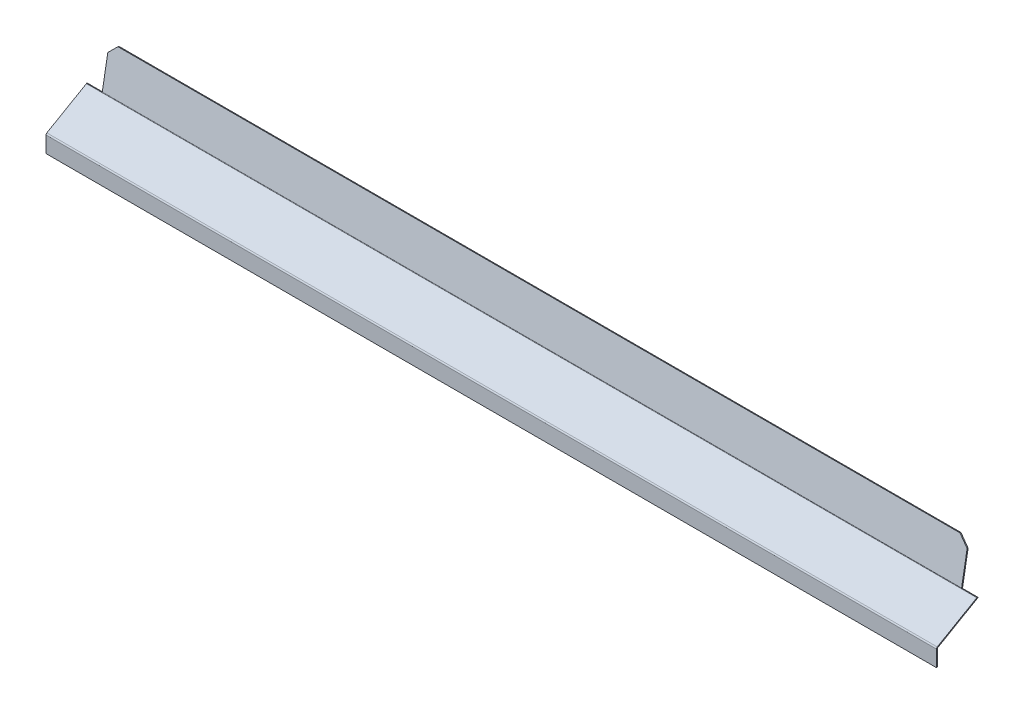
ISO-10303-21;
HEADER;
FILE_DESCRIPTION(('STEP AP214'),'2;1');
FILE_NAME('part.step','',(''),(''),'','','');
FILE_SCHEMA(('AUTOMOTIVE_DESIGN { 1 0 10303 214 1 1 1 1 }'));
ENDSEC;
DATA;
#1=APPLICATION_CONTEXT('core data for automotive mechanical design processes');
#2=APPLICATION_PROTOCOL_DEFINITION('international standard','automotive_design',2000,#1);
#3=PRODUCT_CONTEXT('',#1,'mechanical');
#4=PRODUCT('Part','Part','',(#3));
#5=PRODUCT_RELATED_PRODUCT_CATEGORY('part','',(#4));
#6=PRODUCT_DEFINITION_FORMATION('','',#4);
#7=PRODUCT_DEFINITION_CONTEXT('part definition',#1,'design');
#8=PRODUCT_DEFINITION('design','',#6,#7);
#9=PRODUCT_DEFINITION_SHAPE('','',#8);
#10=(LENGTH_UNIT() NAMED_UNIT(*) SI_UNIT(.MILLI.,.METRE.));
#11=(NAMED_UNIT(*) PLANE_ANGLE_UNIT() SI_UNIT($,.RADIAN.));
#12=(NAMED_UNIT(*) SI_UNIT($,.STERADIAN.) SOLID_ANGLE_UNIT());
#13=UNCERTAINTY_MEASURE_WITH_UNIT(LENGTH_MEASURE(1.E-05),#10,'distance_accuracy_value','');
#14=(GEOMETRIC_REPRESENTATION_CONTEXT(3) GLOBAL_UNCERTAINTY_ASSIGNED_CONTEXT((#13)) GLOBAL_UNIT_ASSIGNED_CONTEXT((#10,
#11,#12)) REPRESENTATION_CONTEXT('',''));
#15=CARTESIAN_POINT('',(0.,0.,0.));
#16=DIRECTION('',(0.,0.,1.));
#17=DIRECTION('',(1.,0.,0.));
#18=AXIS2_PLACEMENT_3D('',#15,#16,#17);
#19=CARTESIAN_POINT('',(-514.999999999999,37.1351085053024,-46.3624559304882));
#20=DIRECTION('',(-1.,0.,0.));
#21=DIRECTION('',(0.,-0.173648177666931,-0.984807753012208));
#22=AXIS2_PLACEMENT_3D('',#19,#20,#21);
#23=CYLINDRICAL_SURFACE('',#22,1.9366);
#24=CARTESIAN_POINT('',(-515.,37.1351085053024,-46.3624559304882));
#25=DIRECTION('',(-1.,0.,0.));
#26=DIRECTION('',(0.,0.,1.));
#27=AXIS2_PLACEMENT_3D('',#24,#25,#26);
#28=CIRCLE('',#27,1.9366);
#29=CARTESIAN_POINT('',(-515.,36.2577170242714,-48.0888984430018));
#30=VERTEX_POINT('',#29);
#31=CARTESIAN_POINT('',(-515.,35.4579637083334,-47.3307559304882));
#32=VERTEX_POINT('',#31);
#33=EDGE_CURVE('E376',#30,#32,#28,.T.);
#34=ORIENTED_EDGE('',*,*,#33,.F.);
#35=DIRECTION('',(-1.,0.,0.));
#36=VECTOR('',#35,1.);
#37=CARTESIAN_POINT('',(-514.999999999999,36.2577170242714,-48.0888984430018));
#38=LINE('',#37,#36);
#39=CARTESIAN_POINT('',(-497.,36.2577170242714,-48.0888984430018));
#40=VERTEX_POINT('',#39);
#41=EDGE_CURVE('E219',#40,#30,#38,.T.);
#42=ORIENTED_EDGE('',*,*,#41,.F.);
#43=CARTESIAN_POINT('',(-497.,37.1351085053024,-46.3624559304882));
#44=DIRECTION('',(1.,0.,0.));
#45=DIRECTION('',(0.,0.,-1.));
#46=AXIS2_PLACEMENT_3D('',#43,#44,#45);
#47=CIRCLE('',#46,1.9366);
#48=CARTESIAN_POINT('',(-497.,36.7988214444325,-48.2696346249717));
#49=VERTEX_POINT('',#48);
#50=EDGE_CURVE('E431',#49,#40,#47,.F.);
#51=ORIENTED_EDGE('',*,*,#50,.F.);
#52=DIRECTION('',(-1.,0.,0.));
#53=VECTOR('',#52,1.);
#54=CARTESIAN_POINT('',(0.,36.7988214444326,-48.2696346249717));
#55=LINE('',#54,#53);
#56=CARTESIAN_POINT('',(497.,36.7988214444326,-48.2696346249717));
#57=VERTEX_POINT('',#56);
#58=EDGE_CURVE('E387',#57,#49,#55,.T.);
#59=ORIENTED_EDGE('',*,*,#58,.F.);
#60=CARTESIAN_POINT('',(497.,37.1351085053023,-46.3624559304882));
#61=DIRECTION('',(-1.,0.,0.));
#62=DIRECTION('',(0.,0.,1.));
#63=AXIS2_PLACEMENT_3D('',#60,#61,#62);
#64=CIRCLE('',#63,1.9366);
#65=CARTESIAN_POINT('',(497.,36.2577170242714,-48.0888984430018));
#66=VERTEX_POINT('',#65);
#67=EDGE_CURVE('E409',#57,#66,#64,.T.);
#68=ORIENTED_EDGE('',*,*,#67,.T.);
#69=DIRECTION('',(1.,0.,0.));
#70=VECTOR('',#69,1.);
#71=CARTESIAN_POINT('',(496.999999999999,36.2577170242714,-48.0888984430018));
#72=LINE('',#71,#70);
#73=CARTESIAN_POINT('',(514.999999999999,36.2577170242719,-48.0888984430021));
#74=VERTEX_POINT('',#73);
#75=EDGE_CURVE('E399',#66,#74,#72,.T.);
#76=ORIENTED_EDGE('',*,*,#75,.T.);
#77=CARTESIAN_POINT('',(514.999999999999,37.1351085053024,-46.3624559304882));
#78=DIRECTION('',(-1.,0.,0.));
#79=DIRECTION('',(0.,0.,1.));
#80=AXIS2_PLACEMENT_3D('',#77,#78,#79);
#81=CIRCLE('',#80,1.9366);
#82=CARTESIAN_POINT('',(515.,35.4579637083334,-47.3307559304882));
#83=VERTEX_POINT('',#82);
#84=EDGE_CURVE('E261',#83,#74,#81,.F.);
#85=ORIENTED_EDGE('',*,*,#84,.F.);
#86=DIRECTION('',(-1.,0.,0.));
#87=VECTOR('',#86,1.);
#88=CARTESIAN_POINT('',(-514.999999999999,35.4579637083334,-47.3307559304882));
#89=LINE('',#88,#87);
#90=EDGE_CURVE('E372',#32,#83,#89,.F.);
#91=ORIENTED_EDGE('',*,*,#90,.F.);
#92=EDGE_LOOP('',(#34,#42,#51,#59,#68,#76,#85,#91));
#93=FACE_BOUND('',#92,.T.);
#94=ADVANCED_FACE('F88',(#93),#23,.T.);
#95=CARTESIAN_POINT('',(-514.999999999999,37.1351085053024,-46.3624559304882));
#96=DIRECTION('',(-1.,0.,0.));
#97=DIRECTION('',(0.,-0.173648177666931,-0.984807753012208));
#98=AXIS2_PLACEMENT_3D('',#95,#96,#97);
#99=CYLINDRICAL_SURFACE('',#98,0.736600000000003);
#100=DIRECTION('',(-1.,0.,0.));
#101=VECTOR('',#100,1.);
#102=CARTESIAN_POINT('',(-514.999999999999,36.8013862266039,-47.0191209902412));
#103=LINE('',#102,#101);
#104=CARTESIAN_POINT('',(-497.,36.8013862266039,-47.0191209902412));
#105=VERTEX_POINT('',#104);
#106=CARTESIAN_POINT('',(-515.,36.8013862266039,-47.0191209902412));
#107=VERTEX_POINT('',#106);
#108=EDGE_CURVE('E216',#105,#107,#103,.T.);
#109=ORIENTED_EDGE('',*,*,#108,.T.);
#110=CARTESIAN_POINT('',(-515.,37.1351085053024,-46.3624559304882));
#111=DIRECTION('',(-1.,0.,0.));
#112=DIRECTION('',(0.,0.,1.));
#113=AXIS2_PLACEMENT_3D('',#110,#111,#112);
#114=CIRCLE('',#113,0.736600000000003);
#115=CARTESIAN_POINT('',(-515.,36.4971941928747,-46.7307559304882));
#116=VERTEX_POINT('',#115);
#117=EDGE_CURVE('E230',#107,#116,#114,.T.);
#118=ORIENTED_EDGE('',*,*,#117,.T.);
#119=DIRECTION('',(-1.,0.,0.));
#120=VECTOR('',#119,1.);
#121=CARTESIAN_POINT('',(-514.999999999999,36.4971941928747,-46.7307559304882));
#122=LINE('',#121,#120);
#123=CARTESIAN_POINT('',(515.,36.4971941928747,-46.7307559304882));
#124=VERTEX_POINT('',#123);
#125=EDGE_CURVE('E242',#116,#124,#122,.F.);
#126=ORIENTED_EDGE('',*,*,#125,.T.);
#127=CARTESIAN_POINT('',(515.,37.1351085053024,-46.3624559304882));
#128=DIRECTION('',(-1.,0.,0.));
#129=DIRECTION('',(0.,0.,1.));
#130=AXIS2_PLACEMENT_3D('',#127,#128,#129);
#131=CIRCLE('',#130,0.736600000000003);
#132=CARTESIAN_POINT('',(515.,36.8013862266044,-47.0191209902414));
#133=VERTEX_POINT('',#132);
#134=EDGE_CURVE('E247',#124,#133,#131,.F.);
#135=ORIENTED_EDGE('',*,*,#134,.T.);
#136=DIRECTION('',(1.,0.,0.));
#137=VECTOR('',#136,1.);
#138=CARTESIAN_POINT('',(-1030.00253631797,36.8013862266039,-47.0191209902411));
#139=LINE('',#138,#137);
#140=CARTESIAN_POINT('',(497.,36.8013862266039,-47.0191209902412));
#141=VERTEX_POINT('',#140);
#142=EDGE_CURVE('E406',#141,#133,#139,.T.);
#143=ORIENTED_EDGE('',*,*,#142,.F.);
#144=CARTESIAN_POINT('',(497.,37.1351085053023,-46.3624559304882));
#145=DIRECTION('',(1.,0.,0.));
#146=DIRECTION('',(0.,0.,-1.));
#147=AXIS2_PLACEMENT_3D('',#144,#145,#146);
#148=CIRCLE('',#147,0.7366);
#149=CARTESIAN_POINT('',(497.,37.0071992576329,-47.087865321357));
#150=VERTEX_POINT('',#149);
#151=EDGE_CURVE('E417',#150,#141,#148,.F.);
#152=ORIENTED_EDGE('',*,*,#151,.F.);
#153=DIRECTION('',(1.,0.,0.));
#154=VECTOR('',#153,1.);
#155=CARTESIAN_POINT('',(515.,37.0071992576329,-47.087865321357));
#156=LINE('',#155,#154);
#157=CARTESIAN_POINT('',(-497.,37.0071992576329,-47.087865321357));
#158=VERTEX_POINT('',#157);
#159=EDGE_CURVE('E384',#150,#158,#156,.F.);
#160=ORIENTED_EDGE('',*,*,#159,.T.);
#161=CARTESIAN_POINT('',(-497.,37.1351085053024,-46.3624559304882));
#162=DIRECTION('',(-1.,0.,0.));
#163=DIRECTION('',(0.,0.,1.));
#164=AXIS2_PLACEMENT_3D('',#161,#162,#163);
#165=CIRCLE('',#164,0.736600000000003);
#166=EDGE_CURVE('E234',#158,#105,#165,.T.);
#167=ORIENTED_EDGE('',*,*,#166,.T.);
#168=EDGE_LOOP('',(#109,#118,#126,#135,#143,#152,#160,#167));
#169=FACE_BOUND('',#168,.T.);
#170=ADVANCED_FACE('F229',(#169),#99,.F.);
#171=CARTESIAN_POINT('',(0.,-8.13659562341442,-40.3463082065226));
#172=DIRECTION('',(0.,-0.173648177666931,-0.984807753012208));
#173=DIRECTION('',(0.,0.984807753012208,-0.173648177666931));
#174=AXIS2_PLACEMENT_3D('',#171,#172,#173);
#175=PLANE('',#174);
#176=DIRECTION('',(0.,0.984807753012208,-0.173648177666931));
#177=VECTOR('',#176,1.);
#178=CARTESIAN_POINT('',(-497.,59.9107568811308,-52.3448924188536));
#179=LINE('',#178,#177);
#180=CARTESIAN_POINT('',(-497.,73.1746147877068,-54.6836684360663));
#181=VERTEX_POINT('',#180);
#182=EDGE_CURVE('E437',#181,#49,#179,.F.);
#183=ORIENTED_EDGE('',*,*,#182,.F.);
#184=DIRECTION('',(0.707106781186545,0.696364240320022,-0.122787803968973));
#185=VECTOR('',#184,1.);
#186=CARTESIAN_POINT('',(-289.782783448049,277.243736205679,-90.6665604715266));
#187=LINE('',#186,#185);
#188=CARTESIAN_POINT('',(-487.,83.022692317829,-56.4201502127356));
#189=VERTEX_POINT('',#188);
#190=EDGE_CURVE('E13',#181,#189,#187,.T.);
#191=ORIENTED_EDGE('',*,*,#190,.T.);
#192=DIRECTION('',(-1.,0.,0.));
#193=VECTOR('',#192,1.);
#194=CARTESIAN_POINT('',(-515.,83.022692317829,-56.4201502127356));
#195=LINE('',#194,#193);
#196=CARTESIAN_POINT('',(487.,83.022692317829,-56.4201502127356));
#197=VERTEX_POINT('',#196);
#198=EDGE_CURVE('E243',#197,#189,#195,.T.);
#199=ORIENTED_EDGE('',*,*,#198,.F.);
#200=DIRECTION('',(-0.707106781186545,0.696364240320022,-0.122787803968973));
#201=VECTOR('',#200,1.);
#202=CARTESIAN_POINT('',(289.782783448049,277.243736205679,-90.6665604715266));
#203=LINE('',#202,#201);
#204=CARTESIAN_POINT('',(497.,73.1746147877068,-54.6836684360663));
#205=VERTEX_POINT('',#204);
#206=EDGE_CURVE('E354',#197,#205,#203,.F.);
#207=ORIENTED_EDGE('',*,*,#206,.T.);
#208=DIRECTION('',(0.,0.984807753012208,-0.17364817766693));
#209=VECTOR('',#208,1.);
#210=CARTESIAN_POINT('',(497.,-8.1365956234144,-40.3463082065226));
#211=LINE('',#210,#209);
#212=EDGE_CURVE('E388',#205,#57,#211,.F.);
#213=ORIENTED_EDGE('',*,*,#212,.T.);
#214=ORIENTED_EDGE('',*,*,#58,.T.);
#215=EDGE_LOOP('',(#183,#191,#199,#207,#213,#214));
#216=FACE_BOUND('',#215,.T.);
#217=ADVANCED_FACE('F503',(#216),#175,.T.);
#218=CARTESIAN_POINT('',(0.,-7.9282178102141,-39.1645389029079));
#219=DIRECTION('',(0.,-0.173648177666931,-0.984807753012208));
#220=DIRECTION('',(0.,0.984807753012208,-0.173648177666931));
#221=AXIS2_PLACEMENT_3D('',#218,#219,#220);
#222=PLANE('',#221);
#223=DIRECTION('',(1.,0.,0.));
#224=VECTOR('',#223,1.);
#225=CARTESIAN_POINT('',(0.,83.2310701310293,-55.238380909121));
#226=LINE('',#225,#224);
#227=CARTESIAN_POINT('',(487.,83.2310701310293,-55.238380909121));
#228=VERTEX_POINT('',#227);
#229=CARTESIAN_POINT('',(-487.,83.2310701310293,-55.238380909121));
#230=VERTEX_POINT('',#229);
#231=EDGE_CURVE('E250',#228,#230,#226,.F.);
#232=ORIENTED_EDGE('',*,*,#231,.T.);
#233=DIRECTION('',(-0.707106781186545,-0.696364240320022,0.122787803968973));
#234=VECTOR('',#233,1.);
#235=CARTESIAN_POINT('',(-487.,83.2310701310293,-55.238380909121));
#236=LINE('',#235,#234);
#237=CARTESIAN_POINT('',(-497.,73.3829926009071,-53.5018991324517));
#238=VERTEX_POINT('',#237);
#239=EDGE_CURVE('E112',#230,#238,#236,.T.);
#240=ORIENTED_EDGE('',*,*,#239,.T.);
#241=DIRECTION('',(0.,-0.984807753012208,0.173648177666931));
#242=VECTOR('',#241,1.);
#243=CARTESIAN_POINT('',(-497.,-7.9282178102141,-39.1645389029079));
#244=LINE('',#243,#242);
#245=EDGE_CURVE('E434',#238,#158,#244,.T.);
#246=ORIENTED_EDGE('',*,*,#245,.T.);
#247=ORIENTED_EDGE('',*,*,#159,.F.);
#248=DIRECTION('',(0.,-0.984807753012208,0.17364817766693));
#249=VECTOR('',#248,1.);
#250=CARTESIAN_POINT('',(497.,36.4515034247715,-46.9898811529564));
#251=LINE('',#250,#249);
#252=CARTESIAN_POINT('',(497.,73.3829926009071,-53.5018991324517));
#253=VERTEX_POINT('',#252);
#254=EDGE_CURVE('E396',#253,#150,#251,.T.);
#255=ORIENTED_EDGE('',*,*,#254,.F.);
#256=DIRECTION('',(0.707106781186545,-0.696364240320022,0.122787803968973));
#257=VECTOR('',#256,1.);
#258=CARTESIAN_POINT('',(487.,83.2310701310293,-55.238380909121));
#259=LINE('',#258,#257);
#260=EDGE_CURVE('E360',#253,#228,#259,.F.);
#261=ORIENTED_EDGE('',*,*,#260,.T.);
#262=EDGE_LOOP('',(#232,#240,#246,#247,#255,#261));
#263=FACE_BOUND('',#262,.T.);
#264=ADVANCED_FACE('F442',(#263),#222,.F.);
#265=CARTESIAN_POINT('',(-515.,83.022692317829,-56.4201502127356));
#266=DIRECTION('',(0.,0.984807753012208,-0.17364817766693));
#267=DIRECTION('',(0.,0.17364817766693,0.984807753012208));
#268=AXIS2_PLACEMENT_3D('',#265,#266,#267);
#269=PLANE('',#268);
#270=ORIENTED_EDGE('',*,*,#198,.T.);
#271=DIRECTION('',(0.,0.17364817766693,0.984807753012208));
#272=VECTOR('',#271,1.);
#273=CARTESIAN_POINT('',(-487.,83.022692317829,-56.4201502127356));
#274=LINE('',#273,#272);
#275=EDGE_CURVE('E363',#189,#230,#274,.T.);
#276=ORIENTED_EDGE('',*,*,#275,.T.);
#277=ORIENTED_EDGE('',*,*,#231,.F.);
#278=DIRECTION('',(0.,-0.17364817766693,-0.984807753012208));
#279=VECTOR('',#278,1.);
#280=CARTESIAN_POINT('',(487.,83.022692317829,-56.4201502127356));
#281=LINE('',#280,#279);
#282=EDGE_CURVE('E347',#228,#197,#281,.T.);
#283=ORIENTED_EDGE('',*,*,#282,.T.);
#284=EDGE_LOOP('',(#270,#276,#277,#283));
#285=FACE_BOUND('',#284,.T.);
#286=ADVANCED_FACE('F506',(#285),#269,.T.);
#287=CARTESIAN_POINT('',(-515.,37.1351085053024,-46.3624559304882));
#288=DIRECTION('',(1.,0.,0.));
#289=DIRECTION('',(0.,0.,-1.));
#290=AXIS2_PLACEMENT_3D('',#287,#288,#289);
#291=PLANE('',#290);
#292=ORIENTED_EDGE('',*,*,#117,.F.);
#293=DIRECTION('',(0.,-0.453057668610422,-0.891481210633903));
#294=VECTOR('',#293,1.);
#295=CARTESIAN_POINT('',(-515.,36.2577170242714,-48.0888984430018));
#296=LINE('',#295,#294);
#297=EDGE_CURVE('E212',#30,#107,#296,.F.);
#298=ORIENTED_EDGE('',*,*,#297,.F.);
#299=ORIENTED_EDGE('',*,*,#33,.T.);
#300=DIRECTION('',(0.,-0.866025403784439,-0.5));
#301=VECTOR('',#300,1.);
#302=CARTESIAN_POINT('',(-515.,36.4971941928747,-46.7307559304882));
#303=LINE('',#302,#301);
#304=EDGE_CURVE('E239',#116,#32,#303,.T.);
#305=ORIENTED_EDGE('',*,*,#304,.F.);
#306=EDGE_LOOP('',(#292,#298,#299,#305));
#307=FACE_BOUND('',#306,.T.);
#308=ADVANCED_FACE('F237',(#307),#291,.F.);
#309=CARTESIAN_POINT('',(515.,37.1351085053024,-46.3624559304882));
#310=DIRECTION('',(1.,0.,0.));
#311=DIRECTION('',(0.,0.,-1.));
#312=AXIS2_PLACEMENT_3D('',#309,#310,#311);
#313=PLANE('',#312);
#314=ORIENTED_EDGE('',*,*,#84,.T.);
#315=DIRECTION('',(0.,-0.453057668610419,-0.891481210633904));
#316=VECTOR('',#315,1.);
#317=CARTESIAN_POINT('',(515.,36.2577170242714,-48.0888984430018));
#318=LINE('',#317,#316);
#319=EDGE_CURVE('E403',#133,#74,#318,.T.);
#320=ORIENTED_EDGE('',*,*,#319,.F.);
#321=ORIENTED_EDGE('',*,*,#134,.F.);
#322=DIRECTION('',(6.02890591705213E-13,-0.866025403784439,-0.5));
#323=VECTOR('',#322,1.);
#324=CARTESIAN_POINT('',(515.,36.4971941928747,-46.7307559304882));
#325=LINE('',#324,#323);
#326=EDGE_CURVE('E254',#124,#83,#325,.T.);
#327=ORIENTED_EDGE('',*,*,#326,.T.);
#328=EDGE_LOOP('',(#314,#320,#321,#327));
#329=FACE_BOUND('',#328,.T.);
#330=ADVANCED_FACE('F462',(#329),#313,.T.);
#331=CARTESIAN_POINT('',(515.,37.4521796769726,-48.3848393094365));
#332=DIRECTION('',(-1.,0.,0.));
#333=DIRECTION('',(0.,0.,1.));
#334=AXIS2_PLACEMENT_3D('',#331,#332,#333);
#335=PLANE('',#334);
#336=ORIENTED_EDGE('',*,*,#326,.F.);
#337=DIRECTION('',(0.,0.500000000000004,-0.866025403784437));
#338=VECTOR('',#337,1.);
#339=CARTESIAN_POINT('',(515.,6.79147459621551,4.72105968631958));
#340=LINE('',#339,#338);
#341=CARTESIAN_POINT('',(515.,10.0762279426287,-0.968299999999958));
#342=VERTEX_POINT('',#341);
#343=EDGE_CURVE('E266',#342,#124,#340,.T.);
#344=ORIENTED_EDGE('',*,*,#343,.F.);
#345=DIRECTION('',(0.,-0.866025403784437,-0.500000000000004));
#346=VECTOR('',#345,1.);
#347=CARTESIAN_POINT('',(515.,9.03699745808741,-1.56829999999996));
#348=LINE('',#347,#346);
#349=CARTESIAN_POINT('',(515.,9.03699745808745,-1.56829999999989));
#350=VERTEX_POINT('',#349);
#351=EDGE_CURVE('E281',#350,#342,#348,.F.);
#352=ORIENTED_EDGE('',*,*,#351,.F.);
#353=DIRECTION('',(0.,-0.500000000000004,0.866025403784437));
#354=VECTOR('',#353,1.);
#355=CARTESIAN_POINT('',(515.,36.4129491924313,-48.9848393094365));
#356=LINE('',#355,#354);
#357=EDGE_CURVE('E273',#350,#83,#356,.F.);
#358=ORIENTED_EDGE('',*,*,#357,.T.);
#359=EDGE_LOOP('',(#336,#344,#352,#358));
#360=FACE_BOUND('',#359,.T.);
#361=ADVANCED_FACE('F472',(#360),#335,.F.);
#362=CARTESIAN_POINT('',(-515.,9.86358983848621,-0.599999999999995));
#363=DIRECTION('',(1.,0.,0.));
#364=DIRECTION('',(0.,0.,-1.));
#365=AXIS2_PLACEMENT_3D('',#362,#363,#364);
#366=PLANE('',#365);
#367=ORIENTED_EDGE('',*,*,#304,.T.);
#368=DIRECTION('',(0.,0.500000000000004,-0.866025403784437));
#369=VECTOR('',#368,1.);
#370=CARTESIAN_POINT('',(-515.,8.82435935394489,-1.2));
#371=LINE('',#370,#369);
#372=CARTESIAN_POINT('',(-515.,9.03699745808745,-1.56830000000004));
#373=VERTEX_POINT('',#372);
#374=EDGE_CURVE('E270',#32,#373,#371,.F.);
#375=ORIENTED_EDGE('',*,*,#374,.T.);
#376=DIRECTION('',(0.,-0.866025403784437,-0.500000000000004));
#377=VECTOR('',#376,1.);
#378=CARTESIAN_POINT('',(-515.,10.0762279426288,-0.968299999999992));
#379=LINE('',#378,#377);
#380=CARTESIAN_POINT('',(-515.,10.0762279426288,-0.968300000000031));
#381=VERTEX_POINT('',#380);
#382=EDGE_CURVE('E258',#373,#381,#379,.F.);
#383=ORIENTED_EDGE('',*,*,#382,.T.);
#384=DIRECTION('',(0.,-0.500000000000004,0.866025403784437));
#385=VECTOR('',#384,1.);
#386=CARTESIAN_POINT('',(-515.,6.79147459621551,4.72105968631958));
#387=LINE('',#386,#385);
#388=EDGE_CURVE('E262',#116,#381,#387,.T.);
#389=ORIENTED_EDGE('',*,*,#388,.F.);
#390=EDGE_LOOP('',(#367,#375,#383,#389));
#391=FACE_BOUND('',#390,.T.);
#392=ADVANCED_FACE('F488',(#391),#366,.F.);
#393=CARTESIAN_POINT('',(0.,6.79147459621551,4.72105968631958));
#394=DIRECTION('',(0.,-0.866025403784437,-0.500000000000004));
#395=DIRECTION('',(0.,0.500000000000004,-0.866025403784437));
#396=AXIS2_PLACEMENT_3D('',#393,#394,#395);
#397=PLANE('',#396);
#398=ORIENTED_EDGE('',*,*,#125,.F.);
#399=ORIENTED_EDGE('',*,*,#388,.T.);
#400=DIRECTION('',(1.,0.,0.));
#401=VECTOR('',#400,1.);
#402=CARTESIAN_POINT('',(-515.,10.0762279426288,-0.968299999999992));
#403=LINE('',#402,#401);
#404=EDGE_CURVE('E277',#342,#381,#403,.F.);
#405=ORIENTED_EDGE('',*,*,#404,.F.);
#406=ORIENTED_EDGE('',*,*,#343,.T.);
#407=EDGE_LOOP('',(#398,#399,#405,#406));
#408=FACE_BOUND('',#407,.T.);
#409=ADVANCED_FACE('F478',(#408),#397,.F.);
#410=CARTESIAN_POINT('',(0.,5.75224411167419,4.12105968631958));
#411=DIRECTION('',(0.,-0.866025403784437,-0.500000000000004));
#412=DIRECTION('',(0.,0.500000000000004,-0.866025403784437));
#413=AXIS2_PLACEMENT_3D('',#410,#411,#412);
#414=PLANE('',#413);
#415=ORIENTED_EDGE('',*,*,#374,.F.);
#416=ORIENTED_EDGE('',*,*,#90,.T.);
#417=ORIENTED_EDGE('',*,*,#357,.F.);
#418=DIRECTION('',(1.,0.,0.));
#419=VECTOR('',#418,1.);
#420=CARTESIAN_POINT('',(-515.,9.03699745808743,-1.5683));
#421=LINE('',#420,#419);
#422=EDGE_CURVE('E285',#373,#350,#421,.T.);
#423=ORIENTED_EDGE('',*,*,#422,.F.);
#424=EDGE_LOOP('',(#415,#416,#417,#423));
#425=FACE_BOUND('',#424,.T.);
#426=ADVANCED_FACE('F469',(#425),#414,.T.);
#427=CARTESIAN_POINT('',(515.,10.21,-1.2));
#428=DIRECTION('',(1.,0.,0.));
#429=DIRECTION('',(0.,0.,-1.));
#430=AXIS2_PLACEMENT_3D('',#427,#428,#429);
#431=PLANE('',#430);
#432=DIRECTION('',(0.,1.,0.));
#433=VECTOR('',#432,1.);
#434=CARTESIAN_POINT('',(515.,10.21,-1.2));
#435=LINE('',#434,#433);
#436=CARTESIAN_POINT('',(515.,-10.21,-1.2));
#437=VERTEX_POINT('',#436);
#438=CARTESIAN_POINT('',(515.,8.3990831456598,-1.19999999999987));
#439=VERTEX_POINT('',#438);
#440=EDGE_CURVE('E322',#437,#439,#435,.T.);
#441=ORIENTED_EDGE('',*,*,#440,.T.);
#442=DIRECTION('',(0.,0.,1.));
#443=VECTOR('',#442,1.);
#444=CARTESIAN_POINT('',(515.,8.3990831456598,-1.19999999999987));
#445=LINE('',#444,#443);
#446=CARTESIAN_POINT('',(515.,8.3990831456598,1.32272665043232E-13));
#447=VERTEX_POINT('',#446);
#448=EDGE_CURVE('E300',#439,#447,#445,.T.);
#449=ORIENTED_EDGE('',*,*,#448,.T.);
#450=DIRECTION('',(0.,1.,0.));
#451=VECTOR('',#450,1.);
#452=CARTESIAN_POINT('',(515.,10.21,0.));
#453=LINE('',#452,#451);
#454=CARTESIAN_POINT('',(515.,-10.21,0.));
#455=VERTEX_POINT('',#454);
#456=EDGE_CURVE('E318',#455,#447,#453,.T.);
#457=ORIENTED_EDGE('',*,*,#456,.F.);
#458=DIRECTION('',(0.,0.,1.));
#459=VECTOR('',#458,1.);
#460=CARTESIAN_POINT('',(515.,-10.21,-1.2));
#461=LINE('',#460,#459);
#462=EDGE_CURVE('E344',#437,#455,#461,.T.);
#463=ORIENTED_EDGE('',*,*,#462,.F.);
#464=EDGE_LOOP('',(#441,#449,#457,#463));
#465=FACE_BOUND('',#464,.T.);
#466=ADVANCED_FACE('F513',(#465),#431,.T.);
#467=CARTESIAN_POINT('',(0.,0.,-1.2));
#468=DIRECTION('',(0.,0.,1.));
#469=DIRECTION('',(1.,0.,0.));
#470=AXIS2_PLACEMENT_3D('',#467,#468,#469);
#471=PLANE('',#470);
#472=DIRECTION('',(1.,0.,0.));
#473=VECTOR('',#472,1.);
#474=CARTESIAN_POINT('',(515.,8.3990831456598,-1.19999999999987));
#475=LINE('',#474,#473);
#476=CARTESIAN_POINT('',(-515.,8.3990831456598,-1.20000000000002));
#477=VERTEX_POINT('',#476);
#478=EDGE_CURVE('E308',#439,#477,#475,.F.);
#479=ORIENTED_EDGE('',*,*,#478,.F.);
#480=ORIENTED_EDGE('',*,*,#440,.F.);
#481=DIRECTION('',(1.,0.,0.));
#482=VECTOR('',#481,1.);
#483=CARTESIAN_POINT('',(-515.,-10.21,-1.2));
#484=LINE('',#483,#482);
#485=CARTESIAN_POINT('',(-515.,-10.21,-1.2));
#486=VERTEX_POINT('',#485);
#487=EDGE_CURVE('E330',#486,#437,#484,.T.);
#488=ORIENTED_EDGE('',*,*,#487,.F.);
#489=DIRECTION('',(0.,-1.,0.));
#490=VECTOR('',#489,1.);
#491=CARTESIAN_POINT('',(-515.,10.21,-1.2));
#492=LINE('',#491,#490);
#493=EDGE_CURVE('E326',#477,#486,#492,.T.);
#494=ORIENTED_EDGE('',*,*,#493,.F.);
#495=EDGE_LOOP('',(#479,#480,#488,#494));
#496=FACE_BOUND('',#495,.T.);
#497=ADVANCED_FACE('F517',(#496),#471,.F.);
#498=CARTESIAN_POINT('',(0.,0.,0.));
#499=DIRECTION('',(0.,0.,1.));
#500=DIRECTION('',(1.,0.,0.));
#501=AXIS2_PLACEMENT_3D('',#498,#499,#500);
#502=PLANE('',#501);
#503=ORIENTED_EDGE('',*,*,#456,.T.);
#504=DIRECTION('',(1.,0.,0.));
#505=VECTOR('',#504,1.);
#506=CARTESIAN_POINT('',(515.,8.3990831456598,1.32272665043232E-13));
#507=LINE('',#506,#505);
#508=CARTESIAN_POINT('',(-515.,8.3990831456598,0.));
#509=VERTEX_POINT('',#508);
#510=EDGE_CURVE('E291',#447,#509,#507,.F.);
#511=ORIENTED_EDGE('',*,*,#510,.T.);
#512=DIRECTION('',(0.,-1.,0.));
#513=VECTOR('',#512,1.);
#514=CARTESIAN_POINT('',(-515.,10.21,0.));
#515=LINE('',#514,#513);
#516=CARTESIAN_POINT('',(-515.,-10.21,0.));
#517=VERTEX_POINT('',#516);
#518=EDGE_CURVE('E338',#509,#517,#515,.T.);
#519=ORIENTED_EDGE('',*,*,#518,.T.);
#520=DIRECTION('',(1.,0.,0.));
#521=VECTOR('',#520,1.);
#522=CARTESIAN_POINT('',(-515.,-10.21,0.));
#523=LINE('',#522,#521);
#524=EDGE_CURVE('E327',#517,#455,#523,.T.);
#525=ORIENTED_EDGE('',*,*,#524,.T.);
#526=EDGE_LOOP('',(#503,#511,#519,#525));
#527=FACE_BOUND('',#526,.T.);
#528=ADVANCED_FACE('F523',(#527),#502,.T.);
#529=CARTESIAN_POINT('',(-515.,-10.21,-1.2));
#530=DIRECTION('',(0.,-1.,0.));
#531=DIRECTION('',(0.,0.,-1.));
#532=AXIS2_PLACEMENT_3D('',#529,#530,#531);
#533=PLANE('',#532);
#534=ORIENTED_EDGE('',*,*,#524,.F.);
#535=DIRECTION('',(0.,0.,1.));
#536=VECTOR('',#535,1.);
#537=CARTESIAN_POINT('',(-515.,-10.21,-1.2));
#538=LINE('',#537,#536);
#539=EDGE_CURVE('E334',#486,#517,#538,.T.);
#540=ORIENTED_EDGE('',*,*,#539,.F.);
#541=ORIENTED_EDGE('',*,*,#487,.T.);
#542=ORIENTED_EDGE('',*,*,#462,.T.);
#543=EDGE_LOOP('',(#534,#540,#541,#542));
#544=FACE_BOUND('',#543,.T.);
#545=ADVANCED_FACE('F659',(#544),#533,.T.);
#546=CARTESIAN_POINT('',(-515.,10.21,-1.2));
#547=DIRECTION('',(-1.,0.,0.));
#548=DIRECTION('',(0.,0.,1.));
#549=AXIS2_PLACEMENT_3D('',#546,#547,#548);
#550=PLANE('',#549);
#551=DIRECTION('',(0.,0.,1.));
#552=VECTOR('',#551,1.);
#553=CARTESIAN_POINT('',(-515.,8.3990831456598,-1.20000000000002));
#554=LINE('',#553,#552);
#555=EDGE_CURVE('E314',#477,#509,#554,.T.);
#556=ORIENTED_EDGE('',*,*,#555,.F.);
#557=ORIENTED_EDGE('',*,*,#493,.T.);
#558=ORIENTED_EDGE('',*,*,#539,.T.);
#559=ORIENTED_EDGE('',*,*,#518,.F.);
#560=EDGE_LOOP('',(#556,#557,#558,#559));
#561=FACE_BOUND('',#560,.T.);
#562=ADVANCED_FACE('F527',(#561),#550,.T.);
#563=CARTESIAN_POINT('',(-515.,8.3990831456598,-1.93660000000006));
#564=DIRECTION('',(-1.,0.,0.));
#565=DIRECTION('',(0.,0.,1.));
#566=AXIS2_PLACEMENT_3D('',#563,#564,#565);
#567=PLANE('',#566);
#568=ORIENTED_EDGE('',*,*,#382,.F.);
#569=CARTESIAN_POINT('',(-515.,8.3990831456598,-1.93660000000006));
#570=DIRECTION('',(1.,0.,0.));
#571=DIRECTION('',(0.,0.,-1.));
#572=AXIS2_PLACEMENT_3D('',#569,#570,#571);
#573=CIRCLE('',#572,0.736600000000041);
#574=EDGE_CURVE('E304',#477,#373,#573,.F.);
#575=ORIENTED_EDGE('',*,*,#574,.F.);
#576=ORIENTED_EDGE('',*,*,#555,.T.);
#577=CARTESIAN_POINT('',(-515.,8.3990831456598,-1.93660000000006));
#578=DIRECTION('',(1.,0.,0.));
#579=DIRECTION('',(0.,0.,-1.));
#580=AXIS2_PLACEMENT_3D('',#577,#578,#579);
#581=CIRCLE('',#580,1.93660000000004);
#582=EDGE_CURVE('E295',#509,#381,#581,.F.);
#583=ORIENTED_EDGE('',*,*,#582,.T.);
#584=EDGE_LOOP('',(#568,#575,#576,#583));
#585=FACE_BOUND('',#584,.T.);
#586=ADVANCED_FACE('F484',(#585),#567,.T.);
#587=CARTESIAN_POINT('',(515.,8.3990831456598,-1.93659999999991));
#588=DIRECTION('',(-1.,0.,0.));
#589=DIRECTION('',(0.,0.,1.));
#590=AXIS2_PLACEMENT_3D('',#587,#588,#589);
#591=PLANE('',#590);
#592=CARTESIAN_POINT('',(515.,8.3990831456598,-1.93659999999991));
#593=DIRECTION('',(1.,0.,0.));
#594=DIRECTION('',(0.,0.,-1.));
#595=AXIS2_PLACEMENT_3D('',#592,#593,#594);
#596=CIRCLE('',#595,0.736600000000041);
#597=EDGE_CURVE('E265',#350,#439,#596,.T.);
#598=ORIENTED_EDGE('',*,*,#597,.F.);
#599=ORIENTED_EDGE('',*,*,#351,.T.);
#600=CARTESIAN_POINT('',(515.,8.3990831456598,-1.93659999999991));
#601=DIRECTION('',(1.,0.,0.));
#602=DIRECTION('',(0.,0.,-1.));
#603=AXIS2_PLACEMENT_3D('',#600,#601,#602);
#604=CIRCLE('',#603,1.93660000000004);
#605=EDGE_CURVE('E296',#342,#447,#604,.T.);
#606=ORIENTED_EDGE('',*,*,#605,.T.);
#607=ORIENTED_EDGE('',*,*,#448,.F.);
#608=EDGE_LOOP('',(#598,#599,#606,#607));
#609=FACE_BOUND('',#608,.T.);
#610=ADVANCED_FACE('F476',(#609),#591,.F.);
#611=CARTESIAN_POINT('',(515.,8.3990831456598,-1.93659999999991));
#612=DIRECTION('',(1.,0.,0.));
#613=DIRECTION('',(0.,0.866025403784437,0.500000000000004));
#614=AXIS2_PLACEMENT_3D('',#611,#612,#613);
#615=CYLINDRICAL_SURFACE('',#614,1.93660000000004);
#616=ORIENTED_EDGE('',*,*,#510,.F.);
#617=ORIENTED_EDGE('',*,*,#605,.F.);
#618=ORIENTED_EDGE('',*,*,#404,.T.);
#619=ORIENTED_EDGE('',*,*,#582,.F.);
#620=EDGE_LOOP('',(#616,#617,#618,#619));
#621=FACE_BOUND('',#620,.T.);
#622=ADVANCED_FACE('F481',(#621),#615,.T.);
#623=CARTESIAN_POINT('',(515.,8.3990831456598,-1.93659999999991));
#624=DIRECTION('',(1.,0.,0.));
#625=DIRECTION('',(0.,0.866025403784437,0.500000000000004));
#626=AXIS2_PLACEMENT_3D('',#623,#624,#625);
#627=CYLINDRICAL_SURFACE('',#626,0.736600000000041);
#628=ORIENTED_EDGE('',*,*,#478,.T.);
#629=ORIENTED_EDGE('',*,*,#574,.T.);
#630=ORIENTED_EDGE('',*,*,#422,.T.);
#631=ORIENTED_EDGE('',*,*,#597,.T.);
#632=EDGE_LOOP('',(#628,#629,#630,#631));
#633=FACE_BOUND('',#632,.T.);
#634=ADVANCED_FACE('F555',(#633),#627,.F.);
#635=CARTESIAN_POINT('',(497.,36.4515034247715,-46.9898811529564));
#636=DIRECTION('',(1.,0.,0.));
#637=DIRECTION('',(0.,-0.984807753012208,0.17364817766693));
#638=AXIS2_PLACEMENT_3D('',#635,#636,#637);
#639=PLANE('',#638);
#640=ORIENTED_EDGE('',*,*,#212,.F.);
#641=DIRECTION('',(0.,0.173648177666931,0.984807753012208));
#642=VECTOR('',#641,1.);
#643=CARTESIAN_POINT('',(497.,73.3829926009071,-53.5018991324517));
#644=LINE('',#643,#642);
#645=EDGE_CURVE('E357',#205,#253,#644,.T.);
#646=ORIENTED_EDGE('',*,*,#645,.T.);
#647=ORIENTED_EDGE('',*,*,#254,.T.);
#648=DIRECTION('',(-2.29313854100001E-13,0.173648177666952,0.984807753012204));
#649=VECTOR('',#648,1.);
#650=CARTESIAN_POINT('',(497.,36.7988214444325,-48.2696346249717));
#651=LINE('',#650,#649);
#652=EDGE_CURVE('E420',#57,#150,#651,.T.);
#653=ORIENTED_EDGE('',*,*,#652,.F.);
#654=EDGE_LOOP('',(#640,#646,#647,#653));
#655=FACE_BOUND('',#654,.T.);
#656=ADVANCED_FACE('F553',(#655),#639,.T.);
#657=CARTESIAN_POINT('',(506.,36.2577170242714,-48.0888984430018));
#658=DIRECTION('',(0.,0.891481210633904,-0.453057668610419));
#659=DIRECTION('',(1.,0.,0.));
#660=AXIS2_PLACEMENT_3D('',#657,#658,#659);
#661=PLANE('',#660);
#662=DIRECTION('',(0.,-0.453057668610415,-0.891481210633907));
#663=VECTOR('',#662,1.);
#664=CARTESIAN_POINT('',(497.,36.2577170242714,-48.0888984430018));
#665=LINE('',#664,#663);
#666=EDGE_CURVE('E413',#141,#66,#665,.T.);
#667=ORIENTED_EDGE('',*,*,#666,.F.);
#668=ORIENTED_EDGE('',*,*,#142,.T.);
#669=ORIENTED_EDGE('',*,*,#319,.T.);
#670=ORIENTED_EDGE('',*,*,#75,.F.);
#671=EDGE_LOOP('',(#667,#668,#669,#670));
#672=FACE_BOUND('',#671,.T.);
#673=ADVANCED_FACE('F456',(#672),#661,.T.);
#674=CARTESIAN_POINT('',(497.,37.1351085053023,-46.3624559304882));
#675=DIRECTION('',(1.,0.,0.));
#676=DIRECTION('',(0.,0.,-1.));
#677=AXIS2_PLACEMENT_3D('',#674,#675,#676);
#678=PLANE('',#677);
#679=ORIENTED_EDGE('',*,*,#652,.T.);
#680=ORIENTED_EDGE('',*,*,#151,.T.);
#681=ORIENTED_EDGE('',*,*,#666,.T.);
#682=ORIENTED_EDGE('',*,*,#67,.F.);
#683=EDGE_LOOP('',(#679,#680,#681,#682));
#684=FACE_BOUND('',#683,.T.);
#685=ADVANCED_FACE('F452',(#684),#678,.T.);
#686=CARTESIAN_POINT('',(487.,83.022692317829,-56.4201502127356));
#687=DIRECTION('',(-0.70710678118655,-0.696364240320016,0.122787803968972));
#688=DIRECTION('',(0.,-0.17364817766693,-0.984807753012208));
#689=AXIS2_PLACEMENT_3D('',#686,#687,#688);
#690=PLANE('',#689);
#691=ORIENTED_EDGE('',*,*,#260,.F.);
#692=ORIENTED_EDGE('',*,*,#645,.F.);
#693=ORIENTED_EDGE('',*,*,#206,.F.);
#694=ORIENTED_EDGE('',*,*,#282,.F.);
#695=EDGE_LOOP('',(#691,#692,#693,#694));
#696=FACE_BOUND('',#695,.T.);
#697=ADVANCED_FACE('F530',(#696),#690,.F.);
#698=CARTESIAN_POINT('',(-506.,36.2577170242714,-48.0888984430018));
#699=DIRECTION('',(0.,-0.891481210633903,0.453057668610422));
#700=DIRECTION('',(-1.,0.,0.));
#701=AXIS2_PLACEMENT_3D('',#698,#699,#700);
#702=PLANE('',#701);
#703=DIRECTION('',(0.,-0.453057668610422,-0.891481210633903));
#704=VECTOR('',#703,1.);
#705=CARTESIAN_POINT('',(-497.,36.2577170242714,-48.0888984430018));
#706=LINE('',#705,#704);
#707=EDGE_CURVE('E224',#40,#105,#706,.F.);
#708=ORIENTED_EDGE('',*,*,#707,.F.);
#709=ORIENTED_EDGE('',*,*,#41,.T.);
#710=ORIENTED_EDGE('',*,*,#297,.T.);
#711=ORIENTED_EDGE('',*,*,#108,.F.);
#712=EDGE_LOOP('',(#708,#709,#710,#711));
#713=FACE_BOUND('',#712,.T.);
#714=ADVANCED_FACE('F215',(#713),#702,.F.);
#715=CARTESIAN_POINT('',(-497.,37.1351085053024,-46.3624559304882));
#716=DIRECTION('',(-1.,0.,0.));
#717=DIRECTION('',(0.,0.,1.));
#718=AXIS2_PLACEMENT_3D('',#715,#716,#717);
#719=PLANE('',#718);
#720=ORIENTED_EDGE('',*,*,#50,.T.);
#721=ORIENTED_EDGE('',*,*,#707,.T.);
#722=ORIENTED_EDGE('',*,*,#166,.F.);
#723=DIRECTION('',(0.,-0.173648177666952,-0.984807753012204));
#724=VECTOR('',#723,1.);
#725=CARTESIAN_POINT('',(-497.,36.7988214444325,-48.2696346249717));
#726=LINE('',#725,#724);
#727=EDGE_CURVE('E225',#49,#158,#726,.F.);
#728=ORIENTED_EDGE('',*,*,#727,.F.);
#729=EDGE_LOOP('',(#720,#721,#722,#728));
#730=FACE_BOUND('',#729,.T.);
#731=ADVANCED_FACE('F446',(#730),#719,.T.);
#732=CARTESIAN_POINT('',(-497.,-7.9282178102141,-39.1645389029079));
#733=DIRECTION('',(1.,0.,0.));
#734=DIRECTION('',(0.,-0.984807753012208,0.173648177666931));
#735=AXIS2_PLACEMENT_3D('',#732,#733,#734);
#736=PLANE('',#735);
#737=ORIENTED_EDGE('',*,*,#245,.F.);
#738=DIRECTION('',(0.,0.173648177666931,0.984807753012208));
#739=VECTOR('',#738,1.);
#740=CARTESIAN_POINT('',(-497.,73.3829926009071,-53.5018991324517));
#741=LINE('',#740,#739);
#742=EDGE_CURVE('E98',#238,#181,#741,.F.);
#743=ORIENTED_EDGE('',*,*,#742,.T.);
#744=ORIENTED_EDGE('',*,*,#182,.T.);
#745=ORIENTED_EDGE('',*,*,#727,.T.);
#746=EDGE_LOOP('',(#737,#743,#744,#745));
#747=FACE_BOUND('',#746,.T.);
#748=ADVANCED_FACE('F448',(#747),#736,.F.);
#749=CARTESIAN_POINT('',(-487.,83.022692317829,-56.4201502127356));
#750=DIRECTION('',(-0.70710678118655,0.696364240320016,-0.122787803968972));
#751=DIRECTION('',(0.,-0.17364817766693,-0.984807753012208));
#752=AXIS2_PLACEMENT_3D('',#749,#750,#751);
#753=PLANE('',#752);
#754=ORIENTED_EDGE('',*,*,#190,.F.);
#755=ORIENTED_EDGE('',*,*,#742,.F.);
#756=ORIENTED_EDGE('',*,*,#239,.F.);
#757=ORIENTED_EDGE('',*,*,#275,.F.);
#758=EDGE_LOOP('',(#754,#755,#756,#757));
#759=FACE_BOUND('',#758,.T.);
#760=ADVANCED_FACE('F91',(#759),#753,.T.);
#761=CLOSED_SHELL('',(#94,#170,#217,#264,#286,#308,#330,#361,#392,#409,#426,#466,#497,#528,#545,
#562,#586,#610,#622,#634,#656,#673,#685,#697,#714,#731,#748,#760));
#762=MANIFOLD_SOLID_BREP('B2',#761);
#763=ADVANCED_BREP_SHAPE_REPRESENTATION('',(#18,#762),#14);
#764=SHAPE_DEFINITION_REPRESENTATION(#9,#763);
ENDSEC;
END-ISO-10303-21;
